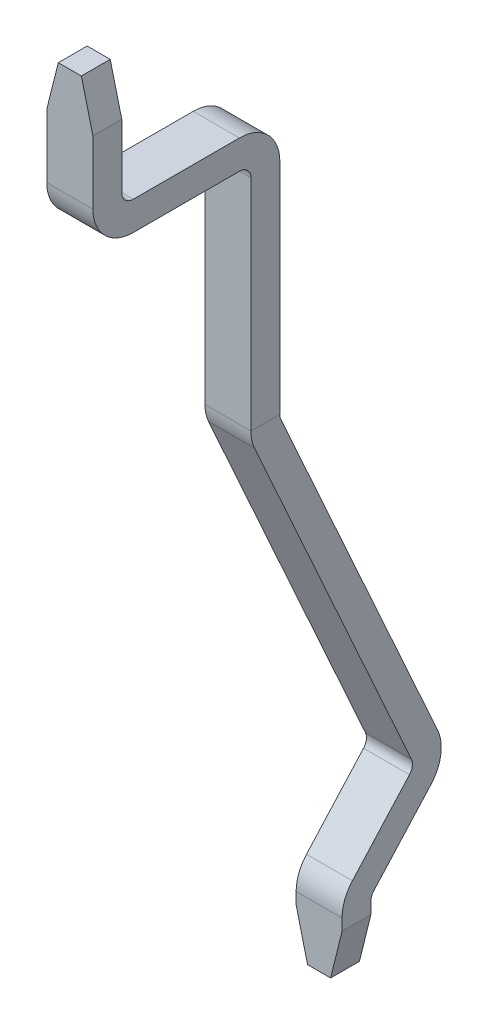
ISO-10303-21;
HEADER;
FILE_DESCRIPTION(('STEP AP214'),'2;1');
FILE_NAME('part.step','',(''),(''),'','','');
FILE_SCHEMA(('AUTOMOTIVE_DESIGN { 1 0 10303 214 1 1 1 1 }'));
ENDSEC;
DATA;
#1=APPLICATION_CONTEXT('core data for automotive mechanical design processes');
#2=APPLICATION_PROTOCOL_DEFINITION('international standard','automotive_design',2000,#1);
#3=PRODUCT_CONTEXT('',#1,'mechanical');
#4=PRODUCT('Part','Part','',(#3));
#5=PRODUCT_RELATED_PRODUCT_CATEGORY('part','',(#4));
#6=PRODUCT_DEFINITION_FORMATION('','',#4);
#7=PRODUCT_DEFINITION_CONTEXT('part definition',#1,'design');
#8=PRODUCT_DEFINITION('design','',#6,#7);
#9=PRODUCT_DEFINITION_SHAPE('','',#8);
#10=(LENGTH_UNIT() NAMED_UNIT(*) SI_UNIT(.MILLI.,.METRE.));
#11=(NAMED_UNIT(*) PLANE_ANGLE_UNIT() SI_UNIT($,.RADIAN.));
#12=(NAMED_UNIT(*) SI_UNIT($,.STERADIAN.) SOLID_ANGLE_UNIT());
#13=UNCERTAINTY_MEASURE_WITH_UNIT(LENGTH_MEASURE(1.E-05),#10,'distance_accuracy_value','');
#14=(GEOMETRIC_REPRESENTATION_CONTEXT(3) GLOBAL_UNCERTAINTY_ASSIGNED_CONTEXT((#13)) GLOBAL_UNIT_ASSIGNED_CONTEXT((#10,
#11,#12)) REPRESENTATION_CONTEXT('',''));
#15=CARTESIAN_POINT('',(0.,0.,0.));
#16=DIRECTION('',(0.,0.,1.));
#17=DIRECTION('',(1.,0.,0.));
#18=AXIS2_PLACEMENT_3D('',#15,#16,#17);
#19=CARTESIAN_POINT('',(-1.6,4.575,1.945));
#20=DIRECTION('',(0.,-1.,0.));
#21=DIRECTION('',(0.,0.,-1.));
#22=AXIS2_PLACEMENT_3D('',#19,#20,#21);
#23=PLANE('',#22);
#24=DIRECTION('',(0.,0.,1.));
#25=VECTOR('',#24,1.);
#26=CARTESIAN_POINT('',(-1.7,4.575,8.99552393868072));
#27=LINE('',#26,#25);
#28=CARTESIAN_POINT('',(-1.7,4.575,1.82));
#29=VERTEX_POINT('',#28);
#30=CARTESIAN_POINT('',(-1.7,4.575,2.07));
#31=VERTEX_POINT('',#30);
#32=EDGE_CURVE('E257',#29,#31,#27,.T.);
#33=ORIENTED_EDGE('',*,*,#32,.T.);
#34=DIRECTION('',(-1.,0.,0.));
#35=VECTOR('',#34,1.);
#36=CARTESIAN_POINT('',(-1.4,4.575,2.07));
#37=LINE('',#36,#35);
#38=CARTESIAN_POINT('',(-1.5,4.575,2.07));
#39=VERTEX_POINT('',#38);
#40=EDGE_CURVE('E228',#31,#39,#37,.F.);
#41=ORIENTED_EDGE('',*,*,#40,.T.);
#42=DIRECTION('',(0.,0.,1.));
#43=VECTOR('',#42,1.);
#44=CARTESIAN_POINT('',(-1.5,4.575,8.99552883706733));
#45=LINE('',#44,#43);
#46=CARTESIAN_POINT('',(-1.5,4.575,1.82));
#47=VERTEX_POINT('',#46);
#48=EDGE_CURVE('E207',#47,#39,#45,.T.);
#49=ORIENTED_EDGE('',*,*,#48,.F.);
#50=DIRECTION('',(1.,0.,0.));
#51=VECTOR('',#50,1.);
#52=CARTESIAN_POINT('',(-1.8,4.575,1.82));
#53=LINE('',#52,#51);
#54=EDGE_CURVE('E244',#47,#29,#53,.F.);
#55=ORIENTED_EDGE('',*,*,#54,.T.);
#56=EDGE_LOOP('',(#33,#41,#49,#55));
#57=FACE_BOUND('',#56,.T.);
#58=ADVANCED_FACE('F17',(#57),#23,.F.);
#59=CARTESIAN_POINT('',(-1.7,4.575,8.99552393868072));
#60=DIRECTION('',(0.970142500145331,-0.242535625036336,0.));
#61=DIRECTION('',(0.242535625036336,0.970142500145331,0.));
#62=AXIS2_PLACEMENT_3D('',#59,#60,#61);
#63=PLANE('',#62);
#64=DIRECTION('',(0.242535625036333,0.970142500145332,0.));
#65=VECTOR('',#64,1.);
#66=CARTESIAN_POINT('',(-1.8,4.175,2.07));
#67=LINE('',#66,#65);
#68=CARTESIAN_POINT('',(-1.8,4.175,2.07));
#69=VERTEX_POINT('',#68);
#70=EDGE_CURVE('E195',#69,#31,#67,.T.);
#71=ORIENTED_EDGE('',*,*,#70,.T.);
#72=ORIENTED_EDGE('',*,*,#32,.F.);
#73=DIRECTION('',(-0.242535625036333,-0.970142500145332,0.));
#74=VECTOR('',#73,1.);
#75=CARTESIAN_POINT('',(-1.7,4.575,1.82));
#76=LINE('',#75,#74);
#77=CARTESIAN_POINT('',(-1.8,4.175,1.82));
#78=VERTEX_POINT('',#77);
#79=EDGE_CURVE('E224',#29,#78,#76,.T.);
#80=ORIENTED_EDGE('',*,*,#79,.T.);
#81=DIRECTION('',(0.,0.,1.));
#82=VECTOR('',#81,1.);
#83=CARTESIAN_POINT('',(-1.8,4.175,2.07));
#84=LINE('',#83,#82);
#85=EDGE_CURVE('E235',#78,#69,#84,.T.);
#86=ORIENTED_EDGE('',*,*,#85,.T.);
#87=EDGE_LOOP('',(#71,#72,#80,#86));
#88=FACE_BOUND('',#87,.T.);
#89=ADVANCED_FACE('F395',(#88),#63,.F.);
#90=CARTESIAN_POINT('',(-1.8,4.575,1.82));
#91=DIRECTION('',(0.,0.,1.));
#92=DIRECTION('',(0.,-1.,0.));
#93=AXIS2_PLACEMENT_3D('',#90,#91,#92);
#94=PLANE('',#93);
#95=ORIENTED_EDGE('',*,*,#79,.F.);
#96=ORIENTED_EDGE('',*,*,#54,.F.);
#97=DIRECTION('',(-0.242535625036336,0.970142500145331,0.));
#98=VECTOR('',#97,1.);
#99=CARTESIAN_POINT('',(-1.5,4.575,1.82));
#100=LINE('',#99,#98);
#101=CARTESIAN_POINT('',(-1.4,4.175,1.82));
#102=VERTEX_POINT('',#101);
#103=EDGE_CURVE('E225',#102,#47,#100,.T.);
#104=ORIENTED_EDGE('',*,*,#103,.F.);
#105=DIRECTION('',(0.,1.,0.));
#106=VECTOR('',#105,1.);
#107=CARTESIAN_POINT('',(-1.4,4.575,1.82));
#108=LINE('',#107,#106);
#109=CARTESIAN_POINT('',(-1.4,3.625,1.82));
#110=VERTEX_POINT('',#109);
#111=EDGE_CURVE('E214',#102,#110,#108,.F.);
#112=ORIENTED_EDGE('',*,*,#111,.T.);
#113=DIRECTION('',(1.,0.,0.));
#114=VECTOR('',#113,1.);
#115=CARTESIAN_POINT('',(-1.6,3.625,1.81999999999999));
#116=LINE('',#115,#114);
#117=CARTESIAN_POINT('',(-1.8,3.625,1.82));
#118=VERTEX_POINT('',#117);
#119=EDGE_CURVE('E222',#110,#118,#116,.F.);
#120=ORIENTED_EDGE('',*,*,#119,.T.);
#121=DIRECTION('',(0.,1.,0.));
#122=VECTOR('',#121,1.);
#123=CARTESIAN_POINT('',(-1.8,4.575,1.82));
#124=LINE('',#123,#122);
#125=EDGE_CURVE('E239',#118,#78,#124,.T.);
#126=ORIENTED_EDGE('',*,*,#125,.T.);
#127=EDGE_LOOP('',(#95,#96,#104,#112,#120,#126));
#128=FACE_BOUND('',#127,.T.);
#129=ADVANCED_FACE('F390',(#128),#94,.F.);
#130=CARTESIAN_POINT('',(-1.6,3.625,1.72));
#131=DIRECTION('',(1.,0.,0.));
#132=DIRECTION('',(0.,1.,0.));
#133=AXIS2_PLACEMENT_3D('',#130,#131,#132);
#134=CYLINDRICAL_SURFACE('',#133,0.0999999999999946);
#135=ORIENTED_EDGE('',*,*,#119,.F.);
#136=CARTESIAN_POINT('',(-1.4,3.625,1.72));
#137=DIRECTION('',(1.,0.,0.));
#138=DIRECTION('',(0.,1.,0.));
#139=AXIS2_PLACEMENT_3D('',#136,#137,#138);
#140=CIRCLE('',#139,0.0999999999999946);
#141=CARTESIAN_POINT('',(-1.4,3.525,1.72));
#142=VERTEX_POINT('',#141);
#143=EDGE_CURVE('E329',#110,#142,#140,.T.);
#144=ORIENTED_EDGE('',*,*,#143,.T.);
#145=DIRECTION('',(1.,0.,0.));
#146=VECTOR('',#145,1.);
#147=CARTESIAN_POINT('',(-1.8,3.525,1.72));
#148=LINE('',#147,#146);
#149=CARTESIAN_POINT('',(-1.8,3.525,1.72));
#150=VERTEX_POINT('',#149);
#151=EDGE_CURVE('E220',#142,#150,#148,.F.);
#152=ORIENTED_EDGE('',*,*,#151,.T.);
#153=CARTESIAN_POINT('',(-1.8,3.625,1.72));
#154=DIRECTION('',(1.,0.,0.));
#155=DIRECTION('',(0.,1.,0.));
#156=AXIS2_PLACEMENT_3D('',#153,#154,#155);
#157=CIRCLE('',#156,0.0999999999999946);
#158=EDGE_CURVE('E334',#150,#118,#157,.F.);
#159=ORIENTED_EDGE('',*,*,#158,.T.);
#160=EDGE_LOOP('',(#135,#144,#152,#159));
#161=FACE_BOUND('',#160,.T.);
#162=ADVANCED_FACE('F387',(#161),#134,.F.);
#163=CARTESIAN_POINT('',(-1.8,3.525,1.72));
#164=DIRECTION('',(0.,-1.,0.));
#165=DIRECTION('',(0.,0.,-1.));
#166=AXIS2_PLACEMENT_3D('',#163,#164,#165);
#167=PLANE('',#166);
#168=ORIENTED_EDGE('',*,*,#151,.F.);
#169=DIRECTION('',(0.,0.,1.));
#170=VECTOR('',#169,1.);
#171=CARTESIAN_POINT('',(-1.4,3.525,1.82));
#172=LINE('',#171,#170);
#173=CARTESIAN_POINT('',(-1.4,3.525,0.800000000000004));
#174=VERTEX_POINT('',#173);
#175=EDGE_CURVE('E328',#142,#174,#172,.F.);
#176=ORIENTED_EDGE('',*,*,#175,.T.);
#177=DIRECTION('',(-1.,0.,0.));
#178=VECTOR('',#177,1.);
#179=CARTESIAN_POINT('',(-1.6,3.525,0.800000000000004));
#180=LINE('',#179,#178);
#181=CARTESIAN_POINT('',(-1.8,3.525,0.800000000000004));
#182=VERTEX_POINT('',#181);
#183=EDGE_CURVE('E171',#182,#174,#180,.F.);
#184=ORIENTED_EDGE('',*,*,#183,.F.);
#185=DIRECTION('',(0.,0.,1.));
#186=VECTOR('',#185,1.);
#187=CARTESIAN_POINT('',(-1.8,3.525,2.07));
#188=LINE('',#187,#186);
#189=EDGE_CURVE('E337',#182,#150,#188,.T.);
#190=ORIENTED_EDGE('',*,*,#189,.T.);
#191=EDGE_LOOP('',(#168,#176,#184,#190));
#192=FACE_BOUND('',#191,.T.);
#193=ADVANCED_FACE('F378',(#192),#167,.F.);
#194=CARTESIAN_POINT('',(-1.6,3.175,0.800000000000004));
#195=DIRECTION('',(-1.,0.,0.));
#196=DIRECTION('',(0.,-1.,0.));
#197=AXIS2_PLACEMENT_3D('',#194,#195,#196);
#198=CYLINDRICAL_SURFACE('',#197,0.350000000000005);
#199=CARTESIAN_POINT('',(-1.4,3.175,0.800000000000004));
#200=DIRECTION('',(-1.,0.,0.));
#201=DIRECTION('',(0.,-1.,0.));
#202=AXIS2_PLACEMENT_3D('',#199,#200,#201);
#203=CIRCLE('',#202,0.350000000000005);
#204=CARTESIAN_POINT('',(-1.4,3.175,0.45));
#205=VERTEX_POINT('',#204);
#206=EDGE_CURVE('E324',#174,#205,#203,.T.);
#207=ORIENTED_EDGE('',*,*,#206,.T.);
#208=DIRECTION('',(1.,0.,0.));
#209=VECTOR('',#208,1.);
#210=CARTESIAN_POINT('',(-1.8,3.175,0.45));
#211=LINE('',#210,#209);
#212=CARTESIAN_POINT('',(-1.8,3.175,0.45));
#213=VERTEX_POINT('',#212);
#214=EDGE_CURVE('E211',#205,#213,#211,.F.);
#215=ORIENTED_EDGE('',*,*,#214,.T.);
#216=CARTESIAN_POINT('',(-1.8,3.175,0.800000000000004));
#217=DIRECTION('',(-1.,0.,0.));
#218=DIRECTION('',(0.,-1.,0.));
#219=AXIS2_PLACEMENT_3D('',#216,#217,#218);
#220=CIRCLE('',#219,0.350000000000005);
#221=EDGE_CURVE('E181',#213,#182,#220,.F.);
#222=ORIENTED_EDGE('',*,*,#221,.T.);
#223=ORIENTED_EDGE('',*,*,#183,.T.);
#224=EDGE_LOOP('',(#207,#215,#222,#223));
#225=FACE_BOUND('',#224,.T.);
#226=ADVANCED_FACE('F383',(#225),#198,.T.);
#227=CARTESIAN_POINT('',(-1.8,3.175,0.45));
#228=DIRECTION('',(0.,0.,1.));
#229=DIRECTION('',(0.,-1.,0.));
#230=AXIS2_PLACEMENT_3D('',#227,#228,#229);
#231=PLANE('',#230);
#232=ORIENTED_EDGE('',*,*,#214,.F.);
#233=DIRECTION('',(0.,1.,0.));
#234=VECTOR('',#233,1.);
#235=CARTESIAN_POINT('',(-1.40000000000001,4.575,0.449999999999999));
#236=LINE('',#235,#234);
#237=CARTESIAN_POINT('',(-1.40000000000001,1.275,0.449999999999999));
#238=VERTEX_POINT('',#237);
#239=EDGE_CURVE('E327',#205,#238,#236,.F.);
#240=ORIENTED_EDGE('',*,*,#239,.T.);
#241=DIRECTION('',(1.,0.,0.));
#242=VECTOR('',#241,1.);
#243=CARTESIAN_POINT('',(-1.40100000000001,1.275,0.449999999999998));
#244=LINE('',#243,#242);
#245=CARTESIAN_POINT('',(-1.401,1.275,0.449999999999999));
#246=VERTEX_POINT('',#245);
#247=EDGE_CURVE('E217',#246,#238,#244,.T.);
#248=ORIENTED_EDGE('',*,*,#247,.F.);
#249=DIRECTION('',(1.,0.,0.));
#250=VECTOR('',#249,1.);
#251=CARTESIAN_POINT('',(-1.8,1.275,0.45));
#252=LINE('',#251,#250);
#253=CARTESIAN_POINT('',(-1.799,1.275,0.449999999999999));
#254=VERTEX_POINT('',#253);
#255=EDGE_CURVE('E166',#254,#246,#252,.T.);
#256=ORIENTED_EDGE('',*,*,#255,.F.);
#257=DIRECTION('',(1.,0.,0.));
#258=VECTOR('',#257,1.);
#259=CARTESIAN_POINT('',(-1.799,1.275,0.45));
#260=LINE('',#259,#258);
#261=CARTESIAN_POINT('',(-1.8,1.275,0.45));
#262=VERTEX_POINT('',#261);
#263=EDGE_CURVE('E20',#262,#254,#260,.T.);
#264=ORIENTED_EDGE('',*,*,#263,.F.);
#265=DIRECTION('',(0.,1.,0.));
#266=VECTOR('',#265,1.);
#267=CARTESIAN_POINT('',(-1.8,4.575,0.45));
#268=LINE('',#267,#266);
#269=EDGE_CURVE('E164',#262,#213,#268,.T.);
#270=ORIENTED_EDGE('',*,*,#269,.T.);
#271=EDGE_LOOP('',(#232,#240,#248,#256,#264,#270));
#272=FACE_BOUND('',#271,.T.);
#273=ADVANCED_FACE('F163',(#272),#231,.F.);
#274=CARTESIAN_POINT('',(-1.4,3.275,1.72));
#275=DIRECTION('',(0.,1.,0.));
#276=DIRECTION('',(0.,0.,1.));
#277=AXIS2_PLACEMENT_3D('',#274,#275,#276);
#278=PLANE('',#277);
#279=DIRECTION('',(1.,0.,0.));
#280=VECTOR('',#279,1.);
#281=CARTESIAN_POINT('',(-1.6,3.27500000000001,1.72));
#282=LINE('',#281,#280);
#283=CARTESIAN_POINT('',(-1.8,3.275,1.72));
#284=VERTEX_POINT('',#283);
#285=CARTESIAN_POINT('',(-1.4,3.275,1.72));
#286=VERTEX_POINT('',#285);
#287=EDGE_CURVE('E196',#284,#286,#282,.T.);
#288=ORIENTED_EDGE('',*,*,#287,.F.);
#289=DIRECTION('',(0.,0.,1.));
#290=VECTOR('',#289,1.);
#291=CARTESIAN_POINT('',(-1.8,3.275,2.07));
#292=LINE('',#291,#290);
#293=CARTESIAN_POINT('',(-1.8,3.275,0.800000000000004));
#294=VERTEX_POINT('',#293);
#295=EDGE_CURVE('E187',#284,#294,#292,.F.);
#296=ORIENTED_EDGE('',*,*,#295,.T.);
#297=DIRECTION('',(-1.,0.,0.));
#298=VECTOR('',#297,1.);
#299=CARTESIAN_POINT('',(-1.6,3.275,0.800000000000004));
#300=LINE('',#299,#298);
#301=CARTESIAN_POINT('',(-1.4,3.275,0.800000000000004));
#302=VERTEX_POINT('',#301);
#303=EDGE_CURVE('E212',#294,#302,#300,.F.);
#304=ORIENTED_EDGE('',*,*,#303,.T.);
#305=DIRECTION('',(0.,0.,1.));
#306=VECTOR('',#305,1.);
#307=CARTESIAN_POINT('',(-1.4,3.275,1.82));
#308=LINE('',#307,#306);
#309=EDGE_CURVE('E319',#302,#286,#308,.T.);
#310=ORIENTED_EDGE('',*,*,#309,.T.);
#311=EDGE_LOOP('',(#288,#296,#304,#310));
#312=FACE_BOUND('',#311,.T.);
#313=ADVANCED_FACE('F534',(#312),#278,.F.);
#314=CARTESIAN_POINT('',(-1.6,3.625,1.72));
#315=DIRECTION('',(1.,0.,0.));
#316=DIRECTION('',(0.,1.,0.));
#317=AXIS2_PLACEMENT_3D('',#314,#315,#316);
#318=CYLINDRICAL_SURFACE('',#317,0.349999999999995);
#319=CARTESIAN_POINT('',(-1.8,3.625,1.72));
#320=DIRECTION('',(1.,0.,0.));
#321=DIRECTION('',(0.,1.,0.));
#322=AXIS2_PLACEMENT_3D('',#319,#320,#321);
#323=CIRCLE('',#322,0.349999999999995);
#324=CARTESIAN_POINT('',(-1.8,3.625,2.07));
#325=VERTEX_POINT('',#324);
#326=EDGE_CURVE('E189',#325,#284,#323,.T.);
#327=ORIENTED_EDGE('',*,*,#326,.T.);
#328=ORIENTED_EDGE('',*,*,#287,.T.);
#329=CARTESIAN_POINT('',(-1.4,3.625,1.72));
#330=DIRECTION('',(1.,0.,0.));
#331=DIRECTION('',(0.,1.,0.));
#332=AXIS2_PLACEMENT_3D('',#329,#330,#331);
#333=CIRCLE('',#332,0.349999999999995);
#334=CARTESIAN_POINT('',(-1.4,3.625,2.07));
#335=VERTEX_POINT('',#334);
#336=EDGE_CURVE('E316',#286,#335,#333,.F.);
#337=ORIENTED_EDGE('',*,*,#336,.T.);
#338=DIRECTION('',(-1.,0.,0.));
#339=VECTOR('',#338,1.);
#340=CARTESIAN_POINT('',(-1.4,3.625,2.07));
#341=LINE('',#340,#339);
#342=EDGE_CURVE('E192',#335,#325,#341,.T.);
#343=ORIENTED_EDGE('',*,*,#342,.T.);
#344=EDGE_LOOP('',(#327,#328,#337,#343));
#345=FACE_BOUND('',#344,.T.);
#346=ADVANCED_FACE('F531',(#345),#318,.T.);
#347=CARTESIAN_POINT('',(-1.4,4.575,2.07));
#348=DIRECTION('',(0.,0.,-1.));
#349=DIRECTION('',(-1.,0.,0.));
#350=AXIS2_PLACEMENT_3D('',#347,#348,#349);
#351=PLANE('',#350);
#352=ORIENTED_EDGE('',*,*,#70,.F.);
#353=DIRECTION('',(0.,1.,0.));
#354=VECTOR('',#353,1.);
#355=CARTESIAN_POINT('',(-1.8,4.575,2.07));
#356=LINE('',#355,#354);
#357=EDGE_CURVE('E238',#69,#325,#356,.F.);
#358=ORIENTED_EDGE('',*,*,#357,.T.);
#359=ORIENTED_EDGE('',*,*,#342,.F.);
#360=DIRECTION('',(0.,1.,0.));
#361=VECTOR('',#360,1.);
#362=CARTESIAN_POINT('',(-1.4,4.575,2.07));
#363=LINE('',#362,#361);
#364=CARTESIAN_POINT('',(-1.4,4.175,2.07));
#365=VERTEX_POINT('',#364);
#366=EDGE_CURVE('E201',#335,#365,#363,.T.);
#367=ORIENTED_EDGE('',*,*,#366,.T.);
#368=DIRECTION('',(-0.242535625036336,0.970142500145331,0.));
#369=VECTOR('',#368,1.);
#370=CARTESIAN_POINT('',(-1.5,4.575,2.07));
#371=LINE('',#370,#369);
#372=EDGE_CURVE('E204',#39,#365,#371,.F.);
#373=ORIENTED_EDGE('',*,*,#372,.F.);
#374=ORIENTED_EDGE('',*,*,#40,.F.);
#375=EDGE_LOOP('',(#352,#358,#359,#367,#373,#374));
#376=FACE_BOUND('',#375,.T.);
#377=ADVANCED_FACE('F527',(#376),#351,.F.);
#378=CARTESIAN_POINT('',(-1.5,4.575,8.99552883706733));
#379=DIRECTION('',(0.970142500145331,0.242535625036336,0.));
#380=DIRECTION('',(-0.242535625036336,0.970142500145331,0.));
#381=AXIS2_PLACEMENT_3D('',#378,#379,#380);
#382=PLANE('',#381);
#383=ORIENTED_EDGE('',*,*,#372,.T.);
#384=DIRECTION('',(0.,0.,1.));
#385=VECTOR('',#384,1.);
#386=CARTESIAN_POINT('',(-1.4,4.175,1.82));
#387=LINE('',#386,#385);
#388=EDGE_CURVE('E197',#365,#102,#387,.F.);
#389=ORIENTED_EDGE('',*,*,#388,.T.);
#390=ORIENTED_EDGE('',*,*,#103,.T.);
#391=ORIENTED_EDGE('',*,*,#48,.T.);
#392=EDGE_LOOP('',(#383,#389,#390,#391));
#393=FACE_BOUND('',#392,.T.);
#394=ADVANCED_FACE('F524',(#393),#382,.T.);
#395=CARTESIAN_POINT('',(-1.8,4.575,2.07));
#396=DIRECTION('',(1.,0.,0.));
#397=DIRECTION('',(0.,1.,0.));
#398=AXIS2_PLACEMENT_3D('',#395,#396,#397);
#399=PLANE('',#398);
#400=ORIENTED_EDGE('',*,*,#85,.F.);
#401=ORIENTED_EDGE('',*,*,#125,.F.);
#402=ORIENTED_EDGE('',*,*,#158,.F.);
#403=ORIENTED_EDGE('',*,*,#189,.F.);
#404=ORIENTED_EDGE('',*,*,#221,.F.);
#405=ORIENTED_EDGE('',*,*,#269,.F.);
#406=DIRECTION('',(0.,0.,1.));
#407=VECTOR('',#406,1.);
#408=CARTESIAN_POINT('',(-1.8,1.275,2.07));
#409=LINE('',#408,#407);
#410=CARTESIAN_POINT('',(-1.8,1.275,0.7));
#411=VERTEX_POINT('',#410);
#412=EDGE_CURVE('E177',#411,#262,#409,.F.);
#413=ORIENTED_EDGE('',*,*,#412,.F.);
#414=DIRECTION('',(0.,1.,0.));
#415=VECTOR('',#414,1.);
#416=CARTESIAN_POINT('',(-1.8,3.175,0.7));
#417=LINE('',#416,#415);
#418=CARTESIAN_POINT('',(-1.8,3.175,0.7));
#419=VERTEX_POINT('',#418);
#420=EDGE_CURVE('E200',#411,#419,#417,.T.);
#421=ORIENTED_EDGE('',*,*,#420,.T.);
#422=CARTESIAN_POINT('',(-1.8,3.175,0.800000000000004));
#423=DIRECTION('',(-1.,0.,0.));
#424=DIRECTION('',(0.,-1.,0.));
#425=AXIS2_PLACEMENT_3D('',#422,#423,#424);
#426=CIRCLE('',#425,0.100000000000005);
#427=EDGE_CURVE('E215',#419,#294,#426,.F.);
#428=ORIENTED_EDGE('',*,*,#427,.T.);
#429=ORIENTED_EDGE('',*,*,#295,.F.);
#430=ORIENTED_EDGE('',*,*,#326,.F.);
#431=ORIENTED_EDGE('',*,*,#357,.F.);
#432=EDGE_LOOP('',(#400,#401,#402,#403,#404,#405,#413,#421,#428,#429,#430,#431));
#433=FACE_BOUND('',#432,.T.);
#434=ADVANCED_FACE('F175',(#433),#399,.F.);
#435=CARTESIAN_POINT('',(-1.6,3.175,0.800000000000004));
#436=DIRECTION('',(-1.,0.,0.));
#437=DIRECTION('',(0.,-1.,0.));
#438=AXIS2_PLACEMENT_3D('',#435,#436,#437);
#439=CYLINDRICAL_SURFACE('',#438,0.100000000000005);
#440=ORIENTED_EDGE('',*,*,#303,.F.);
#441=ORIENTED_EDGE('',*,*,#427,.F.);
#442=DIRECTION('',(-1.,0.,0.));
#443=VECTOR('',#442,1.);
#444=CARTESIAN_POINT('',(-1.4,3.175,0.7));
#445=LINE('',#444,#443);
#446=CARTESIAN_POINT('',(-1.4,3.175,0.7));
#447=VERTEX_POINT('',#446);
#448=EDGE_CURVE('E365',#419,#447,#445,.F.);
#449=ORIENTED_EDGE('',*,*,#448,.T.);
#450=CARTESIAN_POINT('',(-1.4,3.175,0.800000000000004));
#451=DIRECTION('',(-1.,0.,0.));
#452=DIRECTION('',(0.,-1.,0.));
#453=AXIS2_PLACEMENT_3D('',#450,#451,#452);
#454=CIRCLE('',#453,0.100000000000005);
#455=EDGE_CURVE('E320',#447,#302,#454,.F.);
#456=ORIENTED_EDGE('',*,*,#455,.T.);
#457=EDGE_LOOP('',(#440,#441,#449,#456));
#458=FACE_BOUND('',#457,.T.);
#459=ADVANCED_FACE('F518',(#458),#439,.F.);
#460=CARTESIAN_POINT('',(-1.4,4.575,1.82));
#461=DIRECTION('',(-1.,0.,0.));
#462=DIRECTION('',(0.,0.,1.));
#463=AXIS2_PLACEMENT_3D('',#460,#461,#462);
#464=PLANE('',#463);
#465=ORIENTED_EDGE('',*,*,#366,.F.);
#466=ORIENTED_EDGE('',*,*,#336,.F.);
#467=ORIENTED_EDGE('',*,*,#309,.F.);
#468=ORIENTED_EDGE('',*,*,#455,.F.);
#469=DIRECTION('',(0.,1.,0.));
#470=VECTOR('',#469,1.);
#471=CARTESIAN_POINT('',(-1.4,3.175,0.7));
#472=LINE('',#471,#470);
#473=CARTESIAN_POINT('',(-1.4,1.275,0.7));
#474=VERTEX_POINT('',#473);
#475=EDGE_CURVE('E353',#447,#474,#472,.F.);
#476=ORIENTED_EDGE('',*,*,#475,.T.);
#477=DIRECTION('',(0.,0.,1.));
#478=VECTOR('',#477,1.);
#479=CARTESIAN_POINT('',(-1.4,1.275,1.82));
#480=LINE('',#479,#478);
#481=EDGE_CURVE('E323',#238,#474,#480,.T.);
#482=ORIENTED_EDGE('',*,*,#481,.F.);
#483=ORIENTED_EDGE('',*,*,#239,.F.);
#484=ORIENTED_EDGE('',*,*,#206,.F.);
#485=ORIENTED_EDGE('',*,*,#175,.F.);
#486=ORIENTED_EDGE('',*,*,#143,.F.);
#487=ORIENTED_EDGE('',*,*,#111,.F.);
#488=ORIENTED_EDGE('',*,*,#388,.F.);
#489=EDGE_LOOP('',(#465,#466,#467,#468,#476,#482,#483,#484,#485,#486,#487,#488));
#490=FACE_BOUND('',#489,.T.);
#491=ADVANCED_FACE('F350',(#490),#464,.F.);
#492=CARTESIAN_POINT('',(-1.6,-3.275,-0.215));
#493=DIRECTION('',(0.,-1.,0.));
#494=DIRECTION('',(0.,0.,-1.));
#495=AXIS2_PLACEMENT_3D('',#492,#493,#494);
#496=PLANE('',#495);
#497=DIRECTION('',(1.,0.,0.));
#498=VECTOR('',#497,1.);
#499=CARTESIAN_POINT('',(-1.4,-3.275,-0.0900000000000004));
#500=LINE('',#499,#498);
#501=CARTESIAN_POINT('',(-1.5,-3.275,-0.0900000000000002));
#502=VERTEX_POINT('',#501);
#503=CARTESIAN_POINT('',(-1.7,-3.275,-0.0900000000000002));
#504=VERTEX_POINT('',#503);
#505=EDGE_CURVE('E638',#502,#504,#500,.F.);
#506=ORIENTED_EDGE('',*,*,#505,.T.);
#507=DIRECTION('',(0.,0.,1.));
#508=VECTOR('',#507,1.);
#509=CARTESIAN_POINT('',(-1.7,-3.275,-7.84552393868072));
#510=LINE('',#509,#508);
#511=CARTESIAN_POINT('',(-1.7,-3.275,-0.34));
#512=VERTEX_POINT('',#511);
#513=EDGE_CURVE('E314',#504,#512,#510,.F.);
#514=ORIENTED_EDGE('',*,*,#513,.T.);
#515=DIRECTION('',(1.,0.,0.));
#516=VECTOR('',#515,1.);
#517=CARTESIAN_POINT('',(-1.8,-3.275,-0.34));
#518=LINE('',#517,#516);
#519=CARTESIAN_POINT('',(-1.5,-3.275,-0.34));
#520=VERTEX_POINT('',#519);
#521=EDGE_CURVE('E594',#512,#520,#518,.T.);
#522=ORIENTED_EDGE('',*,*,#521,.T.);
#523=DIRECTION('',(0.,0.,1.));
#524=VECTOR('',#523,1.);
#525=CARTESIAN_POINT('',(-1.5,-3.275,-7.84552393868072));
#526=LINE('',#525,#524);
#527=EDGE_CURVE('E315',#502,#520,#526,.F.);
#528=ORIENTED_EDGE('',*,*,#527,.F.);
#529=EDGE_LOOP('',(#506,#514,#522,#528));
#530=FACE_BOUND('',#529,.T.);
#531=ADVANCED_FACE('F511',(#530),#496,.T.);
#532=CARTESIAN_POINT('',(-1.4,3.175,0.7));
#533=DIRECTION('',(0.,0.,-1.));
#534=DIRECTION('',(-1.,0.,0.));
#535=AXIS2_PLACEMENT_3D('',#532,#533,#534);
#536=PLANE('',#535);
#537=ORIENTED_EDGE('',*,*,#448,.F.);
#538=ORIENTED_EDGE('',*,*,#420,.F.);
#539=DIRECTION('',(-1.,0.,0.));
#540=VECTOR('',#539,1.);
#541=CARTESIAN_POINT('',(-1.4,1.275,0.7));
#542=LINE('',#541,#540);
#543=CARTESIAN_POINT('',(-1.79899999999999,1.275,0.699999999999999));
#544=VERTEX_POINT('',#543);
#545=EDGE_CURVE('E186',#411,#544,#542,.F.);
#546=ORIENTED_EDGE('',*,*,#545,.T.);
#547=DIRECTION('',(1.,0.,0.));
#548=VECTOR('',#547,1.);
#549=CARTESIAN_POINT('',(-1.6,1.275,0.699999999999998));
#550=LINE('',#549,#548);
#551=CARTESIAN_POINT('',(-1.401,1.275,0.699999999999999));
#552=VERTEX_POINT('',#551);
#553=EDGE_CURVE('E436',#552,#544,#550,.F.);
#554=ORIENTED_EDGE('',*,*,#553,.F.);
#555=DIRECTION('',(-1.,0.,0.));
#556=VECTOR('',#555,1.);
#557=CARTESIAN_POINT('',(-1.4,1.275,0.7));
#558=LINE('',#557,#556);
#559=EDGE_CURVE('E311',#552,#474,#558,.F.);
#560=ORIENTED_EDGE('',*,*,#559,.T.);
#561=ORIENTED_EDGE('',*,*,#475,.F.);
#562=EDGE_LOOP('',(#537,#538,#546,#554,#560,#561));
#563=FACE_BOUND('',#562,.T.);
#564=ADVANCED_FACE('F507',(#563),#536,.F.);
#565=CARTESIAN_POINT('',(-1.5,-3.275,-7.84552393868072));
#566=DIRECTION('',(0.970710817842158,-0.240250927415917,0.));
#567=DIRECTION('',(0.240250927415917,0.970710817842158,0.));
#568=AXIS2_PLACEMENT_3D('',#565,#566,#567);
#569=PLANE('',#568);
#570=DIRECTION('',(-0.240250927415917,-0.970710817842158,0.));
#571=VECTOR('',#570,1.);
#572=CARTESIAN_POINT('',(-1.40100000000001,-2.875,-0.0900000000000001));
#573=LINE('',#572,#571);
#574=CARTESIAN_POINT('',(-1.40100000000001,-2.875,-0.0900000000000001));
#575=VERTEX_POINT('',#574);
#576=EDGE_CURVE('E634',#575,#502,#573,.T.);
#577=ORIENTED_EDGE('',*,*,#576,.T.);
#578=ORIENTED_EDGE('',*,*,#527,.T.);
#579=DIRECTION('',(0.240250927415917,0.970710817842158,0.));
#580=VECTOR('',#579,1.);
#581=CARTESIAN_POINT('',(-1.5,-3.275,-0.34));
#582=LINE('',#581,#580);
#583=CARTESIAN_POINT('',(-1.40100000000001,-2.875,-0.34));
#584=VERTEX_POINT('',#583);
#585=EDGE_CURVE('E590',#520,#584,#582,.T.);
#586=ORIENTED_EDGE('',*,*,#585,.T.);
#587=DIRECTION('',(0.,0.,-1.));
#588=VECTOR('',#587,1.);
#589=CARTESIAN_POINT('',(-1.401,-2.875,0.7));
#590=LINE('',#589,#588);
#591=EDGE_CURVE('E580',#575,#584,#590,.T.);
#592=ORIENTED_EDGE('',*,*,#591,.F.);
#593=EDGE_LOOP('',(#577,#578,#586,#592));
#594=FACE_BOUND('',#593,.T.);
#595=ADVANCED_FACE('F504',(#594),#569,.T.);
#596=CARTESIAN_POINT('',(-1.40100000000001,1.275,-0.95));
#597=DIRECTION('',(0.,1.,0.));
#598=DIRECTION('',(0.,0.,1.));
#599=AXIS2_PLACEMENT_3D('',#596,#597,#598);
#600=PLANE('',#599);
#601=ORIENTED_EDGE('',*,*,#559,.F.);
#602=DIRECTION('',(0.,0.,-1.));
#603=VECTOR('',#602,1.);
#604=CARTESIAN_POINT('',(-1.401,1.275,0.7));
#605=LINE('',#604,#603);
#606=EDGE_CURVE('E295',#246,#552,#605,.F.);
#607=ORIENTED_EDGE('',*,*,#606,.F.);
#608=ORIENTED_EDGE('',*,*,#247,.T.);
#609=ORIENTED_EDGE('',*,*,#481,.T.);
#610=EDGE_LOOP('',(#601,#607,#608,#609));
#611=FACE_BOUND('',#610,.T.);
#612=ADVANCED_FACE('F343',(#611),#600,.F.);
#613=CARTESIAN_POINT('',(-1.7,-3.275,-7.84552393868072));
#614=DIRECTION('',(0.970710817842158,0.240250927415917,0.));
#615=DIRECTION('',(-0.240250927415917,0.970710817842158,0.));
#616=AXIS2_PLACEMENT_3D('',#613,#614,#615);
#617=PLANE('',#616);
#618=DIRECTION('',(-0.240250927415917,0.970710817842158,0.));
#619=VECTOR('',#618,1.);
#620=CARTESIAN_POINT('',(-1.7,-3.275,-0.0900000000000004));
#621=LINE('',#620,#619);
#622=CARTESIAN_POINT('',(-1.79899999999999,-2.875,-0.0900000000000001));
#623=VERTEX_POINT('',#622);
#624=EDGE_CURVE('E635',#504,#623,#621,.T.);
#625=ORIENTED_EDGE('',*,*,#624,.T.);
#626=DIRECTION('',(0.,0.,1.));
#627=VECTOR('',#626,1.);
#628=CARTESIAN_POINT('',(-1.799,-2.875,0.7));
#629=LINE('',#628,#627);
#630=CARTESIAN_POINT('',(-1.79899999999999,-2.875,-0.34));
#631=VERTEX_POINT('',#630);
#632=EDGE_CURVE('E614',#631,#623,#629,.T.);
#633=ORIENTED_EDGE('',*,*,#632,.F.);
#634=DIRECTION('',(0.240250927415917,-0.970710817842158,0.));
#635=VECTOR('',#634,1.);
#636=CARTESIAN_POINT('',(-1.79899999999999,-2.875,-0.34));
#637=LINE('',#636,#635);
#638=EDGE_CURVE('E608',#631,#512,#637,.T.);
#639=ORIENTED_EDGE('',*,*,#638,.T.);
#640=ORIENTED_EDGE('',*,*,#513,.F.);
#641=EDGE_LOOP('',(#625,#633,#639,#640));
#642=FACE_BOUND('',#641,.T.);
#643=ADVANCED_FACE('F497',(#642),#617,.F.);
#644=CARTESIAN_POINT('',(-1.4,-2.775,-0.0900000000000001));
#645=DIRECTION('',(0.,0.,-1.));
#646=DIRECTION('',(0.,1.,0.));
#647=AXIS2_PLACEMENT_3D('',#644,#645,#646);
#648=PLANE('',#647);
#649=DIRECTION('',(0.,1.,0.));
#650=VECTOR('',#649,1.);
#651=CARTESIAN_POINT('',(-1.40100000000001,-3.275,-0.0900000000000001));
#652=LINE('',#651,#650);
#653=CARTESIAN_POINT('',(-1.40100000000001,-2.775,-0.0900000000000025));
#654=VERTEX_POINT('',#653);
#655=EDGE_CURVE('E586',#654,#575,#652,.F.);
#656=ORIENTED_EDGE('',*,*,#655,.F.);
#657=DIRECTION('',(1.,0.,0.));
#658=VECTOR('',#657,1.);
#659=CARTESIAN_POINT('',(-1.6,-2.775,-0.090000000000005));
#660=LINE('',#659,#658);
#661=CARTESIAN_POINT('',(-1.79899999999999,-2.775,-0.0900000000000025));
#662=VERTEX_POINT('',#661);
#663=EDGE_CURVE('E632',#662,#654,#660,.T.);
#664=ORIENTED_EDGE('',*,*,#663,.F.);
#665=DIRECTION('',(0.,1.,0.));
#666=VECTOR('',#665,1.);
#667=CARTESIAN_POINT('',(-1.79899999999999,-3.275,-0.0900000000000001));
#668=LINE('',#667,#666);
#669=EDGE_CURVE('E284',#623,#662,#668,.T.);
#670=ORIENTED_EDGE('',*,*,#669,.F.);
#671=ORIENTED_EDGE('',*,*,#624,.F.);
#672=ORIENTED_EDGE('',*,*,#505,.F.);
#673=ORIENTED_EDGE('',*,*,#576,.F.);
#674=EDGE_LOOP('',(#656,#664,#670,#671,#672,#673));
#675=FACE_BOUND('',#674,.T.);
#676=ADVANCED_FACE('F493',(#675),#648,.F.);
#677=CARTESIAN_POINT('',(-1.6,-2.775,-0.44));
#678=DIRECTION('',(1.,0.,0.));
#679=DIRECTION('',(0.,1.,0.));
#680=AXIS2_PLACEMENT_3D('',#677,#678,#679);
#681=CYLINDRICAL_SURFACE('',#680,0.349999999999995);
#682=CARTESIAN_POINT('',(-1.40100000000001,-2.775,-0.44));
#683=DIRECTION('',(1.,0.,0.));
#684=DIRECTION('',(0.,1.,0.));
#685=AXIS2_PLACEMENT_3D('',#682,#683,#684);
#686=CIRCLE('',#685,0.349999999999995);
#687=CARTESIAN_POINT('',(-1.40100000000001,-2.54075423726739,-0.179944385482999));
#688=VERTEX_POINT('',#687);
#689=EDGE_CURVE('E289',#688,#654,#686,.T.);
#690=ORIENTED_EDGE('',*,*,#689,.F.);
#691=DIRECTION('',(1.,0.,0.));
#692=VECTOR('',#691,1.);
#693=CARTESIAN_POINT('',(-1.4,-2.54075423726739,-0.179944385483));
#694=LINE('',#693,#692);
#695=CARTESIAN_POINT('',(-1.79899999999999,-2.54075423726739,-0.179944385482999));
#696=VERTEX_POINT('',#695);
#697=EDGE_CURVE('E310',#688,#696,#694,.F.);
#698=ORIENTED_EDGE('',*,*,#697,.T.);
#699=CARTESIAN_POINT('',(-1.79899999999999,-2.775,-0.44));
#700=DIRECTION('',(1.,0.,0.));
#701=DIRECTION('',(0.,1.,0.));
#702=AXIS2_PLACEMENT_3D('',#699,#700,#701);
#703=CIRCLE('',#702,0.349999999999995);
#704=EDGE_CURVE('E282',#662,#696,#703,.F.);
#705=ORIENTED_EDGE('',*,*,#704,.F.);
#706=ORIENTED_EDGE('',*,*,#663,.T.);
#707=EDGE_LOOP('',(#690,#698,#705,#706));
#708=FACE_BOUND('',#707,.T.);
#709=ADVANCED_FACE('F489',(#708),#681,.T.);
#710=CARTESIAN_POINT('',(-1.4,-1.99192736078075,-0.67430160414772));
#711=DIRECTION('',(0.,-0.669273607807463,-0.743016041477155));
#712=DIRECTION('',(0.,0.743016041477155,-0.669273607807463));
#713=AXIS2_PLACEMENT_3D('',#710,#711,#712);
#714=PLANE('',#713);
#715=ORIENTED_EDGE('',*,*,#697,.F.);
#716=DIRECTION('',(0.,-0.743016041477151,0.669273607807469));
#717=VECTOR('',#716,1.);
#718=CARTESIAN_POINT('',(-1.40100000000001,-1.99192736078075,-0.67430160414772));
#719=LINE('',#718,#717);
#720=CARTESIAN_POINT('',(-1.40100000000001,-1.99192736078075,-0.67430160414772));
#721=VERTEX_POINT('',#720);
#722=EDGE_CURVE('E292',#721,#688,#719,.T.);
#723=ORIENTED_EDGE('',*,*,#722,.F.);
#724=DIRECTION('',(-1.,0.,0.));
#725=VECTOR('',#724,1.);
#726=CARTESIAN_POINT('',(-1.6,-1.99192736078075,-0.67430160414772));
#727=LINE('',#726,#725);
#728=CARTESIAN_POINT('',(-1.79899999999999,-1.99192736078075,-0.674301604147719));
#729=VERTEX_POINT('',#728);
#730=EDGE_CURVE('E288',#721,#729,#727,.T.);
#731=ORIENTED_EDGE('',*,*,#730,.T.);
#732=DIRECTION('',(0.,0.743016041477151,-0.669273607807469));
#733=VECTOR('',#732,1.);
#734=CARTESIAN_POINT('',(-1.79899999999999,-2.54075423726739,-0.179944385482996));
#735=LINE('',#734,#733);
#736=EDGE_CURVE('E281',#696,#729,#735,.T.);
#737=ORIENTED_EDGE('',*,*,#736,.F.);
#738=EDGE_LOOP('',(#715,#723,#731,#737));
#739=FACE_BOUND('',#738,.T.);
#740=ADVANCED_FACE('F486',(#739),#714,.F.);
#741=CARTESIAN_POINT('',(-1.799,1.275,0.7));
#742=DIRECTION('',(0.,1.,0.));
#743=DIRECTION('',(0.,0.,1.));
#744=AXIS2_PLACEMENT_3D('',#741,#742,#743);
#745=PLANE('',#744);
#746=ORIENTED_EDGE('',*,*,#545,.F.);
#747=ORIENTED_EDGE('',*,*,#412,.T.);
#748=ORIENTED_EDGE('',*,*,#263,.T.);
#749=DIRECTION('',(0.,0.,1.));
#750=VECTOR('',#749,1.);
#751=CARTESIAN_POINT('',(-1.799,1.275,0.7));
#752=LINE('',#751,#750);
#753=EDGE_CURVE('E276',#544,#254,#752,.F.);
#754=ORIENTED_EDGE('',*,*,#753,.F.);
#755=EDGE_LOOP('',(#746,#747,#748,#754));
#756=FACE_BOUND('',#755,.T.);
#757=ADVANCED_FACE('F184',(#756),#745,.F.);
#758=CARTESIAN_POINT('',(-1.6,1.275,0.350000000000003));
#759=DIRECTION('',(1.,0.,0.));
#760=DIRECTION('',(0.,1.,0.));
#761=AXIS2_PLACEMENT_3D('',#758,#759,#760);
#762=CYLINDRICAL_SURFACE('',#761,0.0999999999999948);
#763=ORIENTED_EDGE('',*,*,#255,.T.);
#764=CARTESIAN_POINT('',(-1.40100000000001,1.275,0.350000000000003));
#765=DIRECTION('',(1.,0.,0.));
#766=DIRECTION('',(0.,1.,0.));
#767=AXIS2_PLACEMENT_3D('',#764,#765,#766);
#768=CIRCLE('',#767,0.0999999999999948);
#769=CARTESIAN_POINT('',(-1.40100000000001,1.23387647540837,0.44115292494024));
#770=VERTEX_POINT('',#769);
#771=EDGE_CURVE('E296',#770,#246,#768,.F.);
#772=ORIENTED_EDGE('',*,*,#771,.F.);
#773=DIRECTION('',(1.,0.,0.));
#774=VECTOR('',#773,1.);
#775=CARTESIAN_POINT('',(-1.8,1.23387647540837,0.44115292494024));
#776=LINE('',#775,#774);
#777=CARTESIAN_POINT('',(-1.799,1.23387647540837,0.44115292494024));
#778=VERTEX_POINT('',#777);
#779=EDGE_CURVE('E309',#770,#778,#776,.F.);
#780=ORIENTED_EDGE('',*,*,#779,.T.);
#781=CARTESIAN_POINT('',(-1.799,1.275,0.350000000000003));
#782=DIRECTION('',(1.,0.,0.));
#783=DIRECTION('',(0.,1.,0.));
#784=AXIS2_PLACEMENT_3D('',#781,#782,#783);
#785=CIRCLE('',#784,0.0999999999999948);
#786=EDGE_CURVE('E273',#254,#778,#785,.T.);
#787=ORIENTED_EDGE('',*,*,#786,.F.);
#788=EDGE_LOOP('',(#763,#772,#780,#787));
#789=FACE_BOUND('',#788,.T.);
#790=ADVANCED_FACE('F479',(#789),#762,.F.);
#791=CARTESIAN_POINT('',(-1.8,1.23387647540837,0.44115292494024));
#792=DIRECTION('',(0.,-0.411235245916341,0.911529249402413));
#793=DIRECTION('',(0.,-0.911529249402413,-0.411235245916341));
#794=AXIS2_PLACEMENT_3D('',#791,#792,#793);
#795=PLANE('',#794);
#796=ORIENTED_EDGE('',*,*,#779,.F.);
#797=DIRECTION('',(0.,0.911529249402413,0.411235245916342));
#798=VECTOR('',#797,1.);
#799=CARTESIAN_POINT('',(-1.40100000000001,-1.78106766392928,-0.91903523729085));
#800=LINE('',#799,#798);
#801=CARTESIAN_POINT('',(-1.40100000000001,-1.78106766392928,-0.91903523729085));
#802=VERTEX_POINT('',#801);
#803=EDGE_CURVE('E299',#802,#770,#800,.T.);
#804=ORIENTED_EDGE('',*,*,#803,.F.);
#805=DIRECTION('',(-1.,0.,0.));
#806=VECTOR('',#805,1.);
#807=CARTESIAN_POINT('',(-1.6,-1.78106766392928,-0.91903523729085));
#808=LINE('',#807,#806);
#809=CARTESIAN_POINT('',(-1.79899999999999,-1.78106766392928,-0.91903523729085));
#810=VERTEX_POINT('',#809);
#811=EDGE_CURVE('E623',#810,#802,#808,.F.);
#812=ORIENTED_EDGE('',*,*,#811,.F.);
#813=DIRECTION('',(0.,-0.911529249402413,-0.411235245916342));
#814=VECTOR('',#813,1.);
#815=CARTESIAN_POINT('',(-1.799,1.23387647540837,0.44115292494024));
#816=LINE('',#815,#814);
#817=EDGE_CURVE('E272',#778,#810,#816,.T.);
#818=ORIENTED_EDGE('',*,*,#817,.F.);
#819=EDGE_LOOP('',(#796,#804,#812,#818));
#820=FACE_BOUND('',#819,.T.);
#821=ADVANCED_FACE('F475',(#820),#795,.F.);
#822=CARTESIAN_POINT('',(-1.6,-1.925,-0.6));
#823=DIRECTION('',(-1.,0.,0.));
#824=DIRECTION('',(0.,-1.,0.));
#825=AXIS2_PLACEMENT_3D('',#822,#823,#824);
#826=CYLINDRICAL_SURFACE('',#825,0.350000000000005);
#827=ORIENTED_EDGE('',*,*,#811,.T.);
#828=CARTESIAN_POINT('',(-1.40100000000001,-1.925,-0.6));
#829=DIRECTION('',(-1.,0.,0.));
#830=DIRECTION('',(0.,-1.,0.));
#831=AXIS2_PLACEMENT_3D('',#828,#829,#830);
#832=CIRCLE('',#831,0.350000000000005);
#833=CARTESIAN_POINT('',(-1.40100000000001,-2.15924576273261,-0.860055614517002));
#834=VERTEX_POINT('',#833);
#835=EDGE_CURVE('E300',#834,#802,#832,.F.);
#836=ORIENTED_EDGE('',*,*,#835,.F.);
#837=DIRECTION('',(1.,0.,0.));
#838=VECTOR('',#837,1.);
#839=CARTESIAN_POINT('',(-1.8,-2.15924576273261,-0.860055614517));
#840=LINE('',#839,#838);
#841=CARTESIAN_POINT('',(-1.79899999999999,-2.15924576273261,-0.860055614517002));
#842=VERTEX_POINT('',#841);
#843=EDGE_CURVE('E620',#834,#842,#840,.F.);
#844=ORIENTED_EDGE('',*,*,#843,.T.);
#845=CARTESIAN_POINT('',(-1.79899999999999,-1.925,-0.6));
#846=DIRECTION('',(-1.,0.,0.));
#847=DIRECTION('',(0.,-1.,0.));
#848=AXIS2_PLACEMENT_3D('',#845,#846,#847);
#849=CIRCLE('',#848,0.350000000000005);
#850=EDGE_CURVE('E269',#810,#842,#849,.T.);
#851=ORIENTED_EDGE('',*,*,#850,.F.);
#852=EDGE_LOOP('',(#827,#836,#844,#851));
#853=FACE_BOUND('',#852,.T.);
#854=ADVANCED_FACE('F471',(#853),#826,.T.);
#855=CARTESIAN_POINT('',(-1.8,-2.15924576273261,-0.860055614517));
#856=DIRECTION('',(0.,0.669273607807463,0.743016041477155));
#857=DIRECTION('',(0.,-0.743016041477155,0.669273607807463));
#858=AXIS2_PLACEMENT_3D('',#855,#856,#857);
#859=PLANE('',#858);
#860=ORIENTED_EDGE('',*,*,#843,.F.);
#861=DIRECTION('',(0.,0.743016041477162,-0.669273607807455));
#862=VECTOR('',#861,1.);
#863=CARTESIAN_POINT('',(-1.40100000000001,-2.70807263921926,-0.365698395852285));
#864=LINE('',#863,#862);
#865=CARTESIAN_POINT('',(-1.40100000000001,-2.70807263921926,-0.365698395852286));
#866=VERTEX_POINT('',#865);
#867=EDGE_CURVE('E303',#866,#834,#864,.T.);
#868=ORIENTED_EDGE('',*,*,#867,.F.);
#869=DIRECTION('',(1.,0.,0.));
#870=VECTOR('',#869,1.);
#871=CARTESIAN_POINT('',(-1.6,-2.70807263921926,-0.365698395852285));
#872=LINE('',#871,#870);
#873=CARTESIAN_POINT('',(-1.79899999999999,-2.70807263921926,-0.365698395852286));
#874=VERTEX_POINT('',#873);
#875=EDGE_CURVE('E609',#866,#874,#872,.F.);
#876=ORIENTED_EDGE('',*,*,#875,.T.);
#877=DIRECTION('',(0.,-0.743016041477162,0.669273607807455));
#878=VECTOR('',#877,1.);
#879=CARTESIAN_POINT('',(-1.79899999999999,-2.15924576273261,-0.860055614517));
#880=LINE('',#879,#878);
#881=EDGE_CURVE('E268',#842,#874,#880,.T.);
#882=ORIENTED_EDGE('',*,*,#881,.F.);
#883=EDGE_LOOP('',(#860,#868,#876,#882));
#884=FACE_BOUND('',#883,.T.);
#885=ADVANCED_FACE('F467',(#884),#859,.F.);
#886=CARTESIAN_POINT('',(-1.6,-2.775,-0.44));
#887=DIRECTION('',(1.,0.,0.));
#888=DIRECTION('',(0.,1.,0.));
#889=AXIS2_PLACEMENT_3D('',#886,#887,#888);
#890=CYLINDRICAL_SURFACE('',#889,0.0999999999999952);
#891=ORIENTED_EDGE('',*,*,#875,.F.);
#892=CARTESIAN_POINT('',(-1.40100000000001,-2.775,-0.44));
#893=DIRECTION('',(1.,0.,0.));
#894=DIRECTION('',(0.,1.,0.));
#895=AXIS2_PLACEMENT_3D('',#892,#893,#894);
#896=CIRCLE('',#895,0.0999999999999952);
#897=CARTESIAN_POINT('',(-1.40100000000001,-2.775,-0.34));
#898=VERTEX_POINT('',#897);
#899=EDGE_CURVE('E304',#898,#866,#896,.F.);
#900=ORIENTED_EDGE('',*,*,#899,.F.);
#901=DIRECTION('',(1.,0.,0.));
#902=VECTOR('',#901,1.);
#903=CARTESIAN_POINT('',(-1.8,-2.775,-0.34));
#904=LINE('',#903,#902);
#905=CARTESIAN_POINT('',(-1.79899999999999,-2.775,-0.34));
#906=VERTEX_POINT('',#905);
#907=EDGE_CURVE('E597',#898,#906,#904,.F.);
#908=ORIENTED_EDGE('',*,*,#907,.T.);
#909=CARTESIAN_POINT('',(-1.79899999999999,-2.775,-0.44));
#910=DIRECTION('',(1.,0.,0.));
#911=DIRECTION('',(0.,1.,0.));
#912=AXIS2_PLACEMENT_3D('',#909,#910,#911);
#913=CIRCLE('',#912,0.0999999999999952);
#914=EDGE_CURVE('E264',#874,#906,#913,.T.);
#915=ORIENTED_EDGE('',*,*,#914,.F.);
#916=EDGE_LOOP('',(#891,#900,#908,#915));
#917=FACE_BOUND('',#916,.T.);
#918=ADVANCED_FACE('F463',(#917),#890,.F.);
#919=CARTESIAN_POINT('',(-1.8,-2.775,-0.34));
#920=DIRECTION('',(0.,0.,1.));
#921=DIRECTION('',(0.,-1.,0.));
#922=AXIS2_PLACEMENT_3D('',#919,#920,#921);
#923=PLANE('',#922);
#924=ORIENTED_EDGE('',*,*,#521,.F.);
#925=ORIENTED_EDGE('',*,*,#638,.F.);
#926=DIRECTION('',(0.,1.,0.));
#927=VECTOR('',#926,1.);
#928=CARTESIAN_POINT('',(-1.79899999999999,-3.275,-0.34));
#929=LINE('',#928,#927);
#930=EDGE_CURVE('E267',#906,#631,#929,.F.);
#931=ORIENTED_EDGE('',*,*,#930,.F.);
#932=ORIENTED_EDGE('',*,*,#907,.F.);
#933=DIRECTION('',(0.,1.,0.));
#934=VECTOR('',#933,1.);
#935=CARTESIAN_POINT('',(-1.40100000000001,-3.275,-0.34));
#936=LINE('',#935,#934);
#937=EDGE_CURVE('E307',#584,#898,#936,.T.);
#938=ORIENTED_EDGE('',*,*,#937,.F.);
#939=ORIENTED_EDGE('',*,*,#585,.F.);
#940=EDGE_LOOP('',(#924,#925,#931,#932,#938,#939));
#941=FACE_BOUND('',#940,.T.);
#942=ADVANCED_FACE('F460',(#941),#923,.F.);
#943=CARTESIAN_POINT('',(-1.6,1.275,0.350000000000003));
#944=DIRECTION('',(1.,0.,0.));
#945=DIRECTION('',(0.,1.,0.));
#946=AXIS2_PLACEMENT_3D('',#943,#944,#945);
#947=CYLINDRICAL_SURFACE('',#946,0.349999999999995);
#948=CARTESIAN_POINT('',(-1.401,1.275,0.350000000000003));
#949=DIRECTION('',(1.,0.,0.));
#950=DIRECTION('',(0.,1.,0.));
#951=AXIS2_PLACEMENT_3D('',#948,#949,#950);
#952=CIRCLE('',#951,0.349999999999995);
#953=CARTESIAN_POINT('',(-1.401,1.13106766392928,0.669035237290844));
#954=VERTEX_POINT('',#953);
#955=EDGE_CURVE('E293',#552,#954,#952,.T.);
#956=ORIENTED_EDGE('',*,*,#955,.F.);
#957=ORIENTED_EDGE('',*,*,#553,.T.);
#958=CARTESIAN_POINT('',(-1.79899999999999,1.275,0.350000000000003));
#959=DIRECTION('',(1.,0.,0.));
#960=DIRECTION('',(0.,1.,0.));
#961=AXIS2_PLACEMENT_3D('',#958,#959,#960);
#962=CIRCLE('',#961,0.349999999999995);
#963=CARTESIAN_POINT('',(-1.79899999999999,1.13106766392928,0.669035237290844));
#964=VERTEX_POINT('',#963);
#965=EDGE_CURVE('E277',#964,#544,#962,.F.);
#966=ORIENTED_EDGE('',*,*,#965,.F.);
#967=DIRECTION('',(1.,0.,0.));
#968=VECTOR('',#967,1.);
#969=CARTESIAN_POINT('',(-1.4,1.13106766392928,0.669035237290843));
#970=LINE('',#969,#968);
#971=EDGE_CURVE('E424',#964,#954,#970,.T.);
#972=ORIENTED_EDGE('',*,*,#971,.T.);
#973=EDGE_LOOP('',(#956,#957,#966,#972));
#974=FACE_BOUND('',#973,.T.);
#975=ADVANCED_FACE('F434',(#974),#947,.T.);
#976=CARTESIAN_POINT('',(-1.401,-3.275,0.7));
#977=DIRECTION('',(1.,0.,0.));
#978=DIRECTION('',(0.,0.,-1.));
#979=AXIS2_PLACEMENT_3D('',#976,#977,#978);
#980=PLANE('',#979);
#981=ORIENTED_EDGE('',*,*,#722,.T.);
#982=ORIENTED_EDGE('',*,*,#689,.T.);
#983=ORIENTED_EDGE('',*,*,#655,.T.);
#984=ORIENTED_EDGE('',*,*,#591,.T.);
#985=ORIENTED_EDGE('',*,*,#937,.T.);
#986=ORIENTED_EDGE('',*,*,#899,.T.);
#987=ORIENTED_EDGE('',*,*,#867,.T.);
#988=ORIENTED_EDGE('',*,*,#835,.T.);
#989=ORIENTED_EDGE('',*,*,#803,.T.);
#990=ORIENTED_EDGE('',*,*,#771,.T.);
#991=ORIENTED_EDGE('',*,*,#606,.T.);
#992=ORIENTED_EDGE('',*,*,#955,.T.);
#993=DIRECTION('',(0.,0.911529249402413,0.411235245916341));
#994=VECTOR('',#993,1.);
#995=CARTESIAN_POINT('',(-1.401,1.13106766392928,0.669035237290843));
#996=LINE('',#995,#994);
#997=CARTESIAN_POINT('',(-1.40100000000001,-1.88387647540836,-0.69115292494024));
#998=VERTEX_POINT('',#997);
#999=EDGE_CURVE('E430',#954,#998,#996,.F.);
#1000=ORIENTED_EDGE('',*,*,#999,.T.);
#1001=CARTESIAN_POINT('',(-1.40100000000001,-1.925,-0.6));
#1002=DIRECTION('',(-1.,0.,0.));
#1003=DIRECTION('',(0.,-1.,0.));
#1004=AXIS2_PLACEMENT_3D('',#1001,#1002,#1003);
#1005=CIRCLE('',#1004,0.100000000000005);
#1006=EDGE_CURVE('E285',#998,#721,#1005,.T.);
#1007=ORIENTED_EDGE('',*,*,#1006,.T.);
#1008=EDGE_LOOP('',(#981,#982,#983,#984,#985,#986,#987,#988,#989,#990,#991,#992,#1000,#1007));
#1009=FACE_BOUND('',#1008,.T.);
#1010=ADVANCED_FACE('F451',(#1009),#980,.T.);
#1011=CARTESIAN_POINT('',(-1.6,-1.925,-0.6));
#1012=DIRECTION('',(-1.,0.,0.));
#1013=DIRECTION('',(0.,-1.,0.));
#1014=AXIS2_PLACEMENT_3D('',#1011,#1012,#1013);
#1015=CYLINDRICAL_SURFACE('',#1014,0.100000000000005);
#1016=ORIENTED_EDGE('',*,*,#730,.F.);
#1017=ORIENTED_EDGE('',*,*,#1006,.F.);
#1018=DIRECTION('',(1.,0.,0.));
#1019=VECTOR('',#1018,1.);
#1020=CARTESIAN_POINT('',(-1.4,-1.88387647540836,-0.691152924940239));
#1021=LINE('',#1020,#1019);
#1022=CARTESIAN_POINT('',(-1.79899999999999,-1.88387647540836,-0.69115292494024));
#1023=VERTEX_POINT('',#1022);
#1024=EDGE_CURVE('E26',#998,#1023,#1021,.F.);
#1025=ORIENTED_EDGE('',*,*,#1024,.T.);
#1026=CARTESIAN_POINT('',(-1.79899999999999,-1.925,-0.6));
#1027=DIRECTION('',(-1.,0.,0.));
#1028=DIRECTION('',(0.,-1.,0.));
#1029=AXIS2_PLACEMENT_3D('',#1026,#1027,#1028);
#1030=CIRCLE('',#1029,0.100000000000005);
#1031=EDGE_CURVE('E34',#729,#1023,#1030,.F.);
#1032=ORIENTED_EDGE('',*,*,#1031,.F.);
#1033=EDGE_LOOP('',(#1016,#1017,#1025,#1032));
#1034=FACE_BOUND('',#1033,.T.);
#1035=ADVANCED_FACE('F443',(#1034),#1015,.F.);
#1036=CARTESIAN_POINT('',(-1.799,-3.275,0.7));
#1037=DIRECTION('',(-1.,0.,0.));
#1038=DIRECTION('',(0.,0.,1.));
#1039=AXIS2_PLACEMENT_3D('',#1036,#1037,#1038);
#1040=PLANE('',#1039);
#1041=ORIENTED_EDGE('',*,*,#914,.T.);
#1042=ORIENTED_EDGE('',*,*,#930,.T.);
#1043=ORIENTED_EDGE('',*,*,#632,.T.);
#1044=ORIENTED_EDGE('',*,*,#669,.T.);
#1045=ORIENTED_EDGE('',*,*,#704,.T.);
#1046=ORIENTED_EDGE('',*,*,#736,.T.);
#1047=ORIENTED_EDGE('',*,*,#1031,.T.);
#1048=DIRECTION('',(0.,0.911529249402413,0.411235245916341));
#1049=VECTOR('',#1048,1.);
#1050=CARTESIAN_POINT('',(-1.79899999999999,1.13106766392928,0.669035237290843));
#1051=LINE('',#1050,#1049);
#1052=EDGE_CURVE('E11',#1023,#964,#1051,.T.);
#1053=ORIENTED_EDGE('',*,*,#1052,.T.);
#1054=ORIENTED_EDGE('',*,*,#965,.T.);
#1055=ORIENTED_EDGE('',*,*,#753,.T.);
#1056=ORIENTED_EDGE('',*,*,#786,.T.);
#1057=ORIENTED_EDGE('',*,*,#817,.T.);
#1058=ORIENTED_EDGE('',*,*,#850,.T.);
#1059=ORIENTED_EDGE('',*,*,#881,.T.);
#1060=EDGE_LOOP('',(#1041,#1042,#1043,#1044,#1045,#1046,#1047,#1053,#1054,#1055,#1056,#1057,
#1058,#1059));
#1061=FACE_BOUND('',#1060,.T.);
#1062=ADVANCED_FACE('F438',(#1061),#1040,.T.);
#1063=CARTESIAN_POINT('',(-1.4,1.13106766392928,0.669035237290843));
#1064=DIRECTION('',(0.,0.411235245916341,-0.911529249402413));
#1065=DIRECTION('',(0.,0.911529249402413,0.411235245916341));
#1066=AXIS2_PLACEMENT_3D('',#1063,#1064,#1065);
#1067=PLANE('',#1066);
#1068=ORIENTED_EDGE('',*,*,#1024,.F.);
#1069=ORIENTED_EDGE('',*,*,#999,.F.);
#1070=ORIENTED_EDGE('',*,*,#971,.F.);
#1071=ORIENTED_EDGE('',*,*,#1052,.F.);
#1072=EDGE_LOOP('',(#1068,#1069,#1070,#1071));
#1073=FACE_BOUND('',#1072,.T.);
#1074=ADVANCED_FACE('F427',(#1073),#1067,.F.);
#1075=CLOSED_SHELL('',(#58,#89,#129,#162,#193,#226,#273,#313,#346,#377,#394,#434,#459,#491,#531,
#564,#595,#612,#643,#676,#709,#740,#757,#790,#821,#854,#885,#918,#942,#975,#1010,#1035,#1062,#1074));
#1076=MANIFOLD_SOLID_BREP('B1',#1075);
#1077=ADVANCED_BREP_SHAPE_REPRESENTATION('',(#18,#1076),#14);
#1078=SHAPE_DEFINITION_REPRESENTATION(#9,#1077);
ENDSEC;
END-ISO-10303-21;
